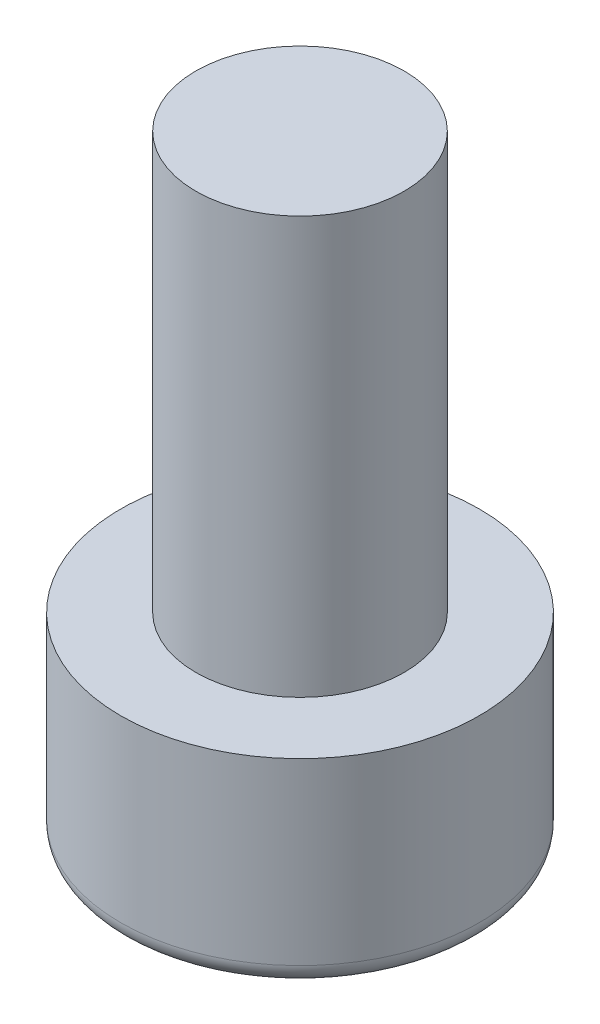
ISO-10303-21;
HEADER;
FILE_DESCRIPTION(('STEP AP214'),'2;1');
FILE_NAME('part.step','',(''),(''),'','','');
FILE_SCHEMA(('AUTOMOTIVE_DESIGN { 1 0 10303 214 1 1 1 1 }'));
ENDSEC;
DATA;
#1=APPLICATION_CONTEXT('core data for automotive mechanical design processes');
#2=APPLICATION_PROTOCOL_DEFINITION('international standard','automotive_design',2000,#1);
#3=PRODUCT_CONTEXT('',#1,'mechanical');
#4=PRODUCT('Part','Part','',(#3));
#5=PRODUCT_RELATED_PRODUCT_CATEGORY('part','',(#4));
#6=PRODUCT_DEFINITION_FORMATION('','',#4);
#7=PRODUCT_DEFINITION_CONTEXT('part definition',#1,'design');
#8=PRODUCT_DEFINITION('design','',#6,#7);
#9=PRODUCT_DEFINITION_SHAPE('','',#8);
#10=(LENGTH_UNIT() NAMED_UNIT(*) SI_UNIT(.MILLI.,.METRE.));
#11=(NAMED_UNIT(*) PLANE_ANGLE_UNIT() SI_UNIT($,.RADIAN.));
#12=(NAMED_UNIT(*) SI_UNIT($,.STERADIAN.) SOLID_ANGLE_UNIT());
#13=UNCERTAINTY_MEASURE_WITH_UNIT(LENGTH_MEASURE(1.E-05),#10,'distance_accuracy_value','');
#14=(GEOMETRIC_REPRESENTATION_CONTEXT(3) GLOBAL_UNCERTAINTY_ASSIGNED_CONTEXT((#13)) GLOBAL_UNIT_ASSIGNED_CONTEXT((#10,
#11,#12)) REPRESENTATION_CONTEXT('',''));
#15=CARTESIAN_POINT('',(0.,0.,0.));
#16=DIRECTION('',(0.,0.,1.));
#17=DIRECTION('',(1.,0.,0.));
#18=AXIS2_PLACEMENT_3D('',#15,#16,#17);
#19=CARTESIAN_POINT('',(0.,4.8,0.));
#20=DIRECTION('',(0.,-1.,0.));
#21=DIRECTION('',(0.,0.,-1.));
#22=AXIS2_PLACEMENT_3D('',#19,#20,#21);
#23=CYLINDRICAL_SURFACE('',#22,4.3);
#24=CARTESIAN_POINT('',(0.,0.5,0.));
#25=DIRECTION('',(0.,1.,0.));
#26=DIRECTION('',(0.,0.,1.));
#27=AXIS2_PLACEMENT_3D('',#24,#25,#26);
#28=CIRCLE('',#27,4.3);
#29=CARTESIAN_POINT('',(0.,0.5,4.3));
#30=VERTEX_POINT('',#29);
#31=EDGE_CURVE('E220',#30,#30,#28,.T.);
#32=ORIENTED_EDGE('',*,*,#31,.T.);
#33=EDGE_LOOP('',(#32));
#34=FACE_BOUND('',#33,.T.);
#35=CARTESIAN_POINT('',(0.,4.8,0.));
#36=DIRECTION('',(0.,1.,0.));
#37=DIRECTION('',(0.,0.,1.));
#38=AXIS2_PLACEMENT_3D('',#35,#36,#37);
#39=CIRCLE('',#38,4.3);
#40=CARTESIAN_POINT('',(0.,4.8,4.3));
#41=VERTEX_POINT('',#40);
#42=EDGE_CURVE('E275',#41,#41,#39,.T.);
#43=ORIENTED_EDGE('',*,*,#42,.F.);
#44=EDGE_LOOP('',(#43));
#45=FACE_BOUND('',#44,.T.);
#46=ADVANCED_FACE('F39',(#34,#45),#23,.T.);
#47=CARTESIAN_POINT('',(0.,4.8,0.));
#48=DIRECTION('',(0.,1.,0.));
#49=DIRECTION('',(0.,0.,1.));
#50=AXIS2_PLACEMENT_3D('',#47,#48,#49);
#51=PLANE('',#50);
#52=CARTESIAN_POINT('',(0.,4.8,0.));
#53=DIRECTION('',(0.,1.,0.));
#54=DIRECTION('',(0.,0.,1.));
#55=AXIS2_PLACEMENT_3D('',#52,#53,#54);
#56=CIRCLE('',#55,2.5);
#57=CARTESIAN_POINT('',(0.,4.8,2.5));
#58=VERTEX_POINT('',#57);
#59=EDGE_CURVE('E163',#58,#58,#56,.T.);
#60=ORIENTED_EDGE('',*,*,#59,.F.);
#61=EDGE_LOOP('',(#60));
#62=FACE_BOUND('',#61,.T.);
#63=ORIENTED_EDGE('',*,*,#42,.T.);
#64=EDGE_LOOP('',(#63));
#65=FACE_BOUND('',#64,.T.);
#66=ADVANCED_FACE('F367',(#62,#65),#51,.T.);
#67=CARTESIAN_POINT('',(0.,0.,0.));
#68=DIRECTION('',(0.,1.,0.));
#69=DIRECTION('',(0.,0.,1.));
#70=AXIS2_PLACEMENT_3D('',#67,#68,#69);
#71=PLANE('',#70);
#72=DIRECTION('',(1.,0.,0.));
#73=VECTOR('',#72,1.);
#74=CARTESIAN_POINT('',(0.,0.,-2.5));
#75=LINE('',#74,#73);
#76=CARTESIAN_POINT('',(1.44337567297406,0.,-2.5));
#77=VERTEX_POINT('',#76);
#78=CARTESIAN_POINT('',(-1.44337567297407,0.,-2.5));
#79=VERTEX_POINT('',#78);
#80=EDGE_CURVE('E254',#77,#79,#75,.F.);
#81=ORIENTED_EDGE('',*,*,#80,.T.);
#82=DIRECTION('',(0.5,0.,-0.866025403784439));
#83=VECTOR('',#82,1.);
#84=CARTESIAN_POINT('',(-2.1650635094611,0.,-1.25));
#85=LINE('',#84,#83);
#86=CARTESIAN_POINT('',(-2.88675134594813,0.,0.));
#87=VERTEX_POINT('',#86);
#88=EDGE_CURVE('E141',#79,#87,#85,.F.);
#89=ORIENTED_EDGE('',*,*,#88,.T.);
#90=DIRECTION('',(-0.5,0.,-0.866025403784438));
#91=VECTOR('',#90,1.);
#92=CARTESIAN_POINT('',(-2.1650635094611,0.,1.25));
#93=LINE('',#92,#91);
#94=CARTESIAN_POINT('',(-1.44337567297406,0.,2.5));
#95=VERTEX_POINT('',#94);
#96=EDGE_CURVE('E266',#87,#95,#93,.F.);
#97=ORIENTED_EDGE('',*,*,#96,.T.);
#98=DIRECTION('',(-1.,0.,0.));
#99=VECTOR('',#98,1.);
#100=CARTESIAN_POINT('',(0.,0.,2.5));
#101=LINE('',#100,#99);
#102=CARTESIAN_POINT('',(1.44337567297407,0.,2.5));
#103=VERTEX_POINT('',#102);
#104=EDGE_CURVE('E263',#95,#103,#101,.F.);
#105=ORIENTED_EDGE('',*,*,#104,.T.);
#106=DIRECTION('',(-0.5,0.,0.866025403784439));
#107=VECTOR('',#106,1.);
#108=CARTESIAN_POINT('',(2.1650635094611,0.,1.25));
#109=LINE('',#108,#107);
#110=CARTESIAN_POINT('',(2.88675134594813,0.,0.));
#111=VERTEX_POINT('',#110);
#112=EDGE_CURVE('E260',#103,#111,#109,.F.);
#113=ORIENTED_EDGE('',*,*,#112,.T.);
#114=DIRECTION('',(0.5,0.,0.866025403784439));
#115=VECTOR('',#114,1.);
#116=CARTESIAN_POINT('',(2.1650635094611,0.,-1.25));
#117=LINE('',#116,#115);
#118=EDGE_CURVE('E257',#111,#77,#117,.F.);
#119=ORIENTED_EDGE('',*,*,#118,.T.);
#120=EDGE_LOOP('',(#81,#89,#97,#105,#113,#119));
#121=FACE_BOUND('',#120,.T.);
#122=CARTESIAN_POINT('',(0.,0.,0.));
#123=DIRECTION('',(0.,1.,0.));
#124=DIRECTION('',(0.,0.,1.));
#125=AXIS2_PLACEMENT_3D('',#122,#123,#124);
#126=CIRCLE('',#125,3.8);
#127=CARTESIAN_POINT('',(0.,0.,3.8));
#128=VERTEX_POINT('',#127);
#129=EDGE_CURVE('E269',#128,#128,#126,.F.);
#130=ORIENTED_EDGE('',*,*,#129,.T.);
#131=EDGE_LOOP('',(#130));
#132=FACE_BOUND('',#131,.T.);
#133=ADVANCED_FACE('F351',(#121,#132),#71,.F.);
#134=CARTESIAN_POINT('',(0.,14.8,0.));
#135=DIRECTION('',(0.,-1.,0.));
#136=DIRECTION('',(0.,0.,-1.));
#137=AXIS2_PLACEMENT_3D('',#134,#135,#136);
#138=CYLINDRICAL_SURFACE('',#137,2.5);
#139=CARTESIAN_POINT('',(0.,14.8,0.));
#140=DIRECTION('',(0.,1.,0.));
#141=DIRECTION('',(0.,0.,1.));
#142=AXIS2_PLACEMENT_3D('',#139,#140,#141);
#143=CIRCLE('',#142,2.5);
#144=CARTESIAN_POINT('',(0.,14.8,2.5));
#145=VERTEX_POINT('',#144);
#146=EDGE_CURVE('E279',#145,#145,#143,.T.);
#147=ORIENTED_EDGE('',*,*,#146,.F.);
#148=EDGE_LOOP('',(#147));
#149=FACE_BOUND('',#148,.T.);
#150=ORIENTED_EDGE('',*,*,#59,.T.);
#151=EDGE_LOOP('',(#150));
#152=FACE_BOUND('',#151,.T.);
#153=ADVANCED_FACE('F377',(#149,#152),#138,.T.);
#154=CARTESIAN_POINT('',(0.,14.8,0.));
#155=DIRECTION('',(0.,1.,0.));
#156=DIRECTION('',(0.,0.,1.));
#157=AXIS2_PLACEMENT_3D('',#154,#155,#156);
#158=PLANE('',#157);
#159=ORIENTED_EDGE('',*,*,#146,.T.);
#160=EDGE_LOOP('',(#159));
#161=FACE_BOUND('',#160,.T.);
#162=ADVANCED_FACE('F381',(#161),#158,.T.);
#163=CARTESIAN_POINT('',(1.15470053837925,3.25,2.));
#164=DIRECTION('',(0.,0.,1.));
#165=DIRECTION('',(1.,0.,0.));
#166=AXIS2_PLACEMENT_3D('',#163,#164,#165);
#167=PLANE('',#166);
#168=DIRECTION('',(0.,-1.,0.));
#169=VECTOR('',#168,1.);
#170=CARTESIAN_POINT('',(1.15470053837925,3.25,2.));
#171=LINE('',#170,#169);
#172=CARTESIAN_POINT('',(1.15470053837925,2.75,2.));
#173=VERTEX_POINT('',#172);
#174=CARTESIAN_POINT('',(1.15470053837925,0.500000000000001,2.));
#175=VERTEX_POINT('',#174);
#176=EDGE_CURVE('E286',#173,#175,#171,.T.);
#177=ORIENTED_EDGE('',*,*,#176,.T.);
#178=DIRECTION('',(-1.,0.,0.));
#179=VECTOR('',#178,1.);
#180=CARTESIAN_POINT('',(1.15470053837925,0.5,2.));
#181=LINE('',#180,#179);
#182=CARTESIAN_POINT('',(-1.15470053837925,0.500000000000001,2.));
#183=VERTEX_POINT('',#182);
#184=EDGE_CURVE('E230',#175,#183,#181,.T.);
#185=ORIENTED_EDGE('',*,*,#184,.T.);
#186=DIRECTION('',(0.,-1.,0.));
#187=VECTOR('',#186,1.);
#188=CARTESIAN_POINT('',(-1.15470053837925,3.25,2.));
#189=LINE('',#188,#187);
#190=CARTESIAN_POINT('',(-1.15470053837925,2.75,2.));
#191=VERTEX_POINT('',#190);
#192=EDGE_CURVE('E192',#191,#183,#189,.T.);
#193=ORIENTED_EDGE('',*,*,#192,.F.);
#194=DIRECTION('',(-1.,0.,0.));
#195=VECTOR('',#194,1.);
#196=CARTESIAN_POINT('',(1.15470053837925,2.75,2.));
#197=LINE('',#196,#195);
#198=EDGE_CURVE('E233',#191,#173,#197,.F.);
#199=ORIENTED_EDGE('',*,*,#198,.T.);
#200=EDGE_LOOP('',(#177,#185,#193,#199));
#201=FACE_BOUND('',#200,.T.);
#202=ADVANCED_FACE('F303',(#201),#167,.F.);
#203=CARTESIAN_POINT('',(2.3094010767585,3.25,0.));
#204=DIRECTION('',(0.866025403784439,0.,0.5));
#205=DIRECTION('',(0.5,0.,-0.866025403784439));
#206=AXIS2_PLACEMENT_3D('',#203,#204,#205);
#207=PLANE('',#206);
#208=DIRECTION('',(0.,-1.,0.));
#209=VECTOR('',#208,1.);
#210=CARTESIAN_POINT('',(2.3094010767585,3.25,0.));
#211=LINE('',#210,#209);
#212=CARTESIAN_POINT('',(2.3094010767585,2.75,0.));
#213=VERTEX_POINT('',#212);
#214=CARTESIAN_POINT('',(2.3094010767585,0.500000000000001,0.));
#215=VERTEX_POINT('',#214);
#216=EDGE_CURVE('E294',#213,#215,#211,.T.);
#217=ORIENTED_EDGE('',*,*,#216,.T.);
#218=DIRECTION('',(-0.5,0.,0.866025403784439));
#219=VECTOR('',#218,1.);
#220=CARTESIAN_POINT('',(2.3094010767585,0.5,0.));
#221=LINE('',#220,#219);
#222=EDGE_CURVE('E236',#215,#175,#221,.T.);
#223=ORIENTED_EDGE('',*,*,#222,.T.);
#224=ORIENTED_EDGE('',*,*,#176,.F.);
#225=DIRECTION('',(-0.5,0.,0.866025403784439));
#226=VECTOR('',#225,1.);
#227=CARTESIAN_POINT('',(2.3094010767585,2.75,0.));
#228=LINE('',#227,#226);
#229=EDGE_CURVE('E239',#173,#213,#228,.F.);
#230=ORIENTED_EDGE('',*,*,#229,.T.);
#231=EDGE_LOOP('',(#217,#223,#224,#230));
#232=FACE_BOUND('',#231,.T.);
#233=ADVANCED_FACE('F336',(#232),#207,.F.);
#234=CARTESIAN_POINT('',(1.15470053837925,3.25,-2.));
#235=DIRECTION('',(0.866025403784438,0.,-0.5));
#236=DIRECTION('',(-0.5,0.,-0.866025403784439));
#237=AXIS2_PLACEMENT_3D('',#234,#235,#236);
#238=PLANE('',#237);
#239=DIRECTION('',(0.,-1.,0.));
#240=VECTOR('',#239,1.);
#241=CARTESIAN_POINT('',(1.15470053837925,3.25,-2.));
#242=LINE('',#241,#240);
#243=CARTESIAN_POINT('',(1.15470053837925,2.75,-2.));
#244=VERTEX_POINT('',#243);
#245=CARTESIAN_POINT('',(1.15470053837925,0.500000000000001,-2.));
#246=VERTEX_POINT('',#245);
#247=EDGE_CURVE('E135',#244,#246,#242,.T.);
#248=ORIENTED_EDGE('',*,*,#247,.T.);
#249=DIRECTION('',(0.5,0.,0.866025403784439));
#250=VECTOR('',#249,1.);
#251=CARTESIAN_POINT('',(1.15470053837925,0.5,-2.));
#252=LINE('',#251,#250);
#253=EDGE_CURVE('E243',#246,#215,#252,.T.);
#254=ORIENTED_EDGE('',*,*,#253,.T.);
#255=ORIENTED_EDGE('',*,*,#216,.F.);
#256=DIRECTION('',(0.5,0.,0.866025403784439));
#257=VECTOR('',#256,1.);
#258=CARTESIAN_POINT('',(1.15470053837925,2.75,-2.));
#259=LINE('',#258,#257);
#260=EDGE_CURVE('E246',#213,#244,#259,.F.);
#261=ORIENTED_EDGE('',*,*,#260,.T.);
#262=EDGE_LOOP('',(#248,#254,#255,#261));
#263=FACE_BOUND('',#262,.T.);
#264=ADVANCED_FACE('F338',(#263),#238,.F.);
#265=CARTESIAN_POINT('',(-1.15470053837925,3.25,-2.));
#266=DIRECTION('',(0.,0.,-1.));
#267=DIRECTION('',(-1.,0.,0.));
#268=AXIS2_PLACEMENT_3D('',#265,#266,#267);
#269=PLANE('',#268);
#270=DIRECTION('',(0.,-1.,0.));
#271=VECTOR('',#270,1.);
#272=CARTESIAN_POINT('',(-1.15470053837925,3.25,-2.));
#273=LINE('',#272,#271);
#274=CARTESIAN_POINT('',(-1.15470053837925,2.75,-2.));
#275=VERTEX_POINT('',#274);
#276=CARTESIAN_POINT('',(-1.15470053837925,0.500000000000001,-2.));
#277=VERTEX_POINT('',#276);
#278=EDGE_CURVE('E133',#275,#277,#273,.T.);
#279=ORIENTED_EDGE('',*,*,#278,.T.);
#280=DIRECTION('',(1.,0.,0.));
#281=VECTOR('',#280,1.);
#282=CARTESIAN_POINT('',(-1.15470053837925,0.5,-2.));
#283=LINE('',#282,#281);
#284=EDGE_CURVE('E140',#277,#246,#283,.T.);
#285=ORIENTED_EDGE('',*,*,#284,.T.);
#286=ORIENTED_EDGE('',*,*,#247,.F.);
#287=DIRECTION('',(1.,0.,0.));
#288=VECTOR('',#287,1.);
#289=CARTESIAN_POINT('',(-1.15470053837925,2.75,-2.));
#290=LINE('',#289,#288);
#291=EDGE_CURVE('E130',#244,#275,#290,.F.);
#292=ORIENTED_EDGE('',*,*,#291,.T.);
#293=EDGE_LOOP('',(#279,#285,#286,#292));
#294=FACE_BOUND('',#293,.T.);
#295=ADVANCED_FACE('F132',(#294),#269,.F.);
#296=CARTESIAN_POINT('',(-2.3094010767585,3.25,0.));
#297=DIRECTION('',(-0.866025403784439,0.,-0.5));
#298=DIRECTION('',(-0.5,0.,0.866025403784439));
#299=AXIS2_PLACEMENT_3D('',#296,#297,#298);
#300=PLANE('',#299);
#301=DIRECTION('',(0.,-1.,0.));
#302=VECTOR('',#301,1.);
#303=CARTESIAN_POINT('',(-2.3094010767585,3.25,0.));
#304=LINE('',#303,#302);
#305=CARTESIAN_POINT('',(-2.3094010767585,2.75,0.));
#306=VERTEX_POINT('',#305);
#307=CARTESIAN_POINT('',(-2.3094010767585,0.500000000000001,0.));
#308=VERTEX_POINT('',#307);
#309=EDGE_CURVE('E153',#306,#308,#304,.T.);
#310=ORIENTED_EDGE('',*,*,#309,.T.);
#311=DIRECTION('',(0.5,0.,-0.866025403784439));
#312=VECTOR('',#311,1.);
#313=CARTESIAN_POINT('',(-2.3094010767585,0.5,0.));
#314=LINE('',#313,#312);
#315=EDGE_CURVE('E151',#308,#277,#314,.T.);
#316=ORIENTED_EDGE('',*,*,#315,.T.);
#317=ORIENTED_EDGE('',*,*,#278,.F.);
#318=DIRECTION('',(0.5,0.,-0.866025403784439));
#319=VECTOR('',#318,1.);
#320=CARTESIAN_POINT('',(-2.3094010767585,2.75,0.));
#321=LINE('',#320,#319);
#322=EDGE_CURVE('E148',#275,#306,#321,.F.);
#323=ORIENTED_EDGE('',*,*,#322,.T.);
#324=EDGE_LOOP('',(#310,#316,#317,#323));
#325=FACE_BOUND('',#324,.T.);
#326=ADVANCED_FACE('F147',(#325),#300,.F.);
#327=CARTESIAN_POINT('',(-1.15470053837925,3.25,2.));
#328=DIRECTION('',(-0.866025403784438,0.,0.5));
#329=DIRECTION('',(0.5,0.,0.866025403784438));
#330=AXIS2_PLACEMENT_3D('',#327,#328,#329);
#331=PLANE('',#330);
#332=ORIENTED_EDGE('',*,*,#192,.T.);
#333=DIRECTION('',(-0.5,0.,-0.866025403784438));
#334=VECTOR('',#333,1.);
#335=CARTESIAN_POINT('',(-1.15470053837925,0.5,2.));
#336=LINE('',#335,#334);
#337=EDGE_CURVE('E224',#183,#308,#336,.T.);
#338=ORIENTED_EDGE('',*,*,#337,.T.);
#339=ORIENTED_EDGE('',*,*,#309,.F.);
#340=DIRECTION('',(-0.5,0.,-0.866025403784438));
#341=VECTOR('',#340,1.);
#342=CARTESIAN_POINT('',(-1.15470053837925,2.75,2.));
#343=LINE('',#342,#341);
#344=EDGE_CURVE('E227',#306,#191,#343,.F.);
#345=ORIENTED_EDGE('',*,*,#344,.T.);
#346=EDGE_LOOP('',(#332,#338,#339,#345));
#347=FACE_BOUND('',#346,.T.);
#348=ADVANCED_FACE('F324',(#347),#331,.F.);
#349=CARTESIAN_POINT('',(0.,3.25,0.));
#350=DIRECTION('',(0.,-1.,0.));
#351=DIRECTION('',(0.,0.,-1.));
#352=AXIS2_PLACEMENT_3D('',#349,#350,#351);
#353=PLANE('',#352);
#354=DIRECTION('',(0.5,0.,0.866025403784439));
#355=VECTOR('',#354,1.);
#356=CARTESIAN_POINT('',(1.29903810567666,3.25,-0.75));
#357=LINE('',#356,#355);
#358=CARTESIAN_POINT('',(0.866025403784438,3.25,-1.5));
#359=VERTEX_POINT('',#358);
#360=CARTESIAN_POINT('',(1.73205080756888,3.25,0.));
#361=VERTEX_POINT('',#360);
#362=EDGE_CURVE('E49',#359,#361,#357,.T.);
#363=ORIENTED_EDGE('',*,*,#362,.T.);
#364=DIRECTION('',(-0.5,0.,0.866025403784439));
#365=VECTOR('',#364,1.);
#366=CARTESIAN_POINT('',(1.29903810567666,3.25,0.75));
#367=LINE('',#366,#365);
#368=CARTESIAN_POINT('',(0.86602540378444,3.25,1.5));
#369=VERTEX_POINT('',#368);
#370=EDGE_CURVE('E11',#361,#369,#367,.T.);
#371=ORIENTED_EDGE('',*,*,#370,.T.);
#372=DIRECTION('',(-1.,0.,0.));
#373=VECTOR('',#372,1.);
#374=CARTESIAN_POINT('',(0.,3.25,1.5));
#375=LINE('',#374,#373);
#376=CARTESIAN_POINT('',(-0.866025403784439,3.25,1.5));
#377=VERTEX_POINT('',#376);
#378=EDGE_CURVE('E217',#369,#377,#375,.T.);
#379=ORIENTED_EDGE('',*,*,#378,.T.);
#380=DIRECTION('',(-0.5,0.,-0.866025403784438));
#381=VECTOR('',#380,1.);
#382=CARTESIAN_POINT('',(-1.29903810567666,3.25,0.750000000000001));
#383=LINE('',#382,#381);
#384=CARTESIAN_POINT('',(-1.73205080756888,3.25,0.));
#385=VERTEX_POINT('',#384);
#386=EDGE_CURVE('E214',#377,#385,#383,.T.);
#387=ORIENTED_EDGE('',*,*,#386,.T.);
#388=DIRECTION('',(0.5,0.,-0.866025403784439));
#389=VECTOR('',#388,1.);
#390=CARTESIAN_POINT('',(-1.29903810567666,3.25,-0.75));
#391=LINE('',#390,#389);
#392=CARTESIAN_POINT('',(-0.86602540378444,3.25,-1.5));
#393=VERTEX_POINT('',#392);
#394=EDGE_CURVE('E211',#385,#393,#391,.T.);
#395=ORIENTED_EDGE('',*,*,#394,.T.);
#396=DIRECTION('',(1.,0.,0.));
#397=VECTOR('',#396,1.);
#398=CARTESIAN_POINT('',(0.,3.25,-1.5));
#399=LINE('',#398,#397);
#400=EDGE_CURVE('E60',#393,#359,#399,.T.);
#401=ORIENTED_EDGE('',*,*,#400,.T.);
#402=EDGE_LOOP('',(#363,#371,#379,#387,#395,#401));
#403=FACE_BOUND('',#402,.T.);
#404=ADVANCED_FACE('F390',(#403),#353,.T.);
#405=CARTESIAN_POINT('',(2.74241377865072,0.5,0.250000000000001));
#406=DIRECTION('',(-0.5,0.,0.866025403784439));
#407=DIRECTION('',(0.866025403784439,0.,0.5));
#408=AXIS2_PLACEMENT_3D('',#405,#406,#407);
#409=CYLINDRICAL_SURFACE('',#408,0.5);
#410=CARTESIAN_POINT('',(2.88675134594813,0.5,0.));
#411=DIRECTION('',(0.,0.,1.));
#412=DIRECTION('',(1.,0.,0.));
#413=AXIS2_PLACEMENT_3D('',#410,#411,#412);
#414=ELLIPSE('',#413,0.577350269189626,0.5);
#415=EDGE_CURVE('E193',#111,#215,#414,.F.);
#416=ORIENTED_EDGE('',*,*,#415,.F.);
#417=ORIENTED_EDGE('',*,*,#112,.F.);
#418=CARTESIAN_POINT('',(1.44337567297407,0.5,2.5));
#419=DIRECTION('',(-0.866025403784438,0.,0.5));
#420=DIRECTION('',(0.5,0.,0.866025403784438));
#421=AXIS2_PLACEMENT_3D('',#418,#419,#420);
#422=ELLIPSE('',#421,0.577350269189626,0.5);
#423=EDGE_CURVE('E188',#175,#103,#422,.T.);
#424=ORIENTED_EDGE('',*,*,#423,.F.);
#425=ORIENTED_EDGE('',*,*,#222,.F.);
#426=EDGE_LOOP('',(#416,#417,#424,#425));
#427=FACE_BOUND('',#426,.T.);
#428=ADVANCED_FACE('F313',(#427),#409,.T.);
#429=CARTESIAN_POINT('',(1.15470053837925,0.5,2.5));
#430=DIRECTION('',(-1.,0.,0.));
#431=DIRECTION('',(0.,0.,1.));
#432=AXIS2_PLACEMENT_3D('',#429,#430,#431);
#433=CYLINDRICAL_SURFACE('',#432,0.5);
#434=ORIENTED_EDGE('',*,*,#423,.T.);
#435=ORIENTED_EDGE('',*,*,#104,.F.);
#436=CARTESIAN_POINT('',(-1.44337567297406,0.5,2.5));
#437=DIRECTION('',(-0.866025403784439,0.,-0.5));
#438=DIRECTION('',(-0.5,0.,0.866025403784439));
#439=AXIS2_PLACEMENT_3D('',#436,#437,#438);
#440=ELLIPSE('',#439,0.577350269189626,0.5);
#441=EDGE_CURVE('E197',#183,#95,#440,.T.);
#442=ORIENTED_EDGE('',*,*,#441,.F.);
#443=ORIENTED_EDGE('',*,*,#184,.F.);
#444=EDGE_LOOP('',(#434,#435,#442,#443));
#445=FACE_BOUND('',#444,.T.);
#446=ADVANCED_FACE('F317',(#445),#433,.T.);
#447=CARTESIAN_POINT('',(1.58771324027147,0.5,-2.25));
#448=DIRECTION('',(0.5,0.,0.866025403784439));
#449=DIRECTION('',(0.866025403784438,0.,-0.5));
#450=AXIS2_PLACEMENT_3D('',#447,#448,#449);
#451=CYLINDRICAL_SURFACE('',#450,0.5);
#452=ORIENTED_EDGE('',*,*,#415,.T.);
#453=ORIENTED_EDGE('',*,*,#253,.F.);
#454=CARTESIAN_POINT('',(1.44337567297406,0.5,-2.5));
#455=DIRECTION('',(0.866025403784439,0.,0.5));
#456=DIRECTION('',(0.5,0.,-0.866025403784439));
#457=AXIS2_PLACEMENT_3D('',#454,#455,#456);
#458=ELLIPSE('',#457,0.577350269189626,0.5);
#459=EDGE_CURVE('E201',#77,#246,#458,.F.);
#460=ORIENTED_EDGE('',*,*,#459,.F.);
#461=ORIENTED_EDGE('',*,*,#118,.F.);
#462=EDGE_LOOP('',(#452,#453,#460,#461));
#463=FACE_BOUND('',#462,.T.);
#464=ADVANCED_FACE('F342',(#463),#451,.T.);
#465=CARTESIAN_POINT('',(-1.58771324027147,0.5,2.25));
#466=DIRECTION('',(-0.5,0.,-0.866025403784438));
#467=DIRECTION('',(-0.866025403784438,0.,0.5));
#468=AXIS2_PLACEMENT_3D('',#465,#466,#467);
#469=CYLINDRICAL_SURFACE('',#468,0.5);
#470=ORIENTED_EDGE('',*,*,#441,.T.);
#471=ORIENTED_EDGE('',*,*,#96,.F.);
#472=CARTESIAN_POINT('',(-2.88675134594813,0.5,0.));
#473=DIRECTION('',(0.,0.,-1.));
#474=DIRECTION('',(1.,0.,0.));
#475=AXIS2_PLACEMENT_3D('',#472,#473,#474);
#476=ELLIPSE('',#475,0.577350269189626,0.5);
#477=EDGE_CURVE('E170',#308,#87,#476,.T.);
#478=ORIENTED_EDGE('',*,*,#477,.F.);
#479=ORIENTED_EDGE('',*,*,#337,.F.);
#480=EDGE_LOOP('',(#470,#471,#478,#479));
#481=FACE_BOUND('',#480,.T.);
#482=ADVANCED_FACE('F322',(#481),#469,.T.);
#483=CARTESIAN_POINT('',(-1.15470053837925,0.5,-2.5));
#484=DIRECTION('',(1.,0.,0.));
#485=DIRECTION('',(0.,0.,-1.));
#486=AXIS2_PLACEMENT_3D('',#483,#484,#485);
#487=CYLINDRICAL_SURFACE('',#486,0.5);
#488=ORIENTED_EDGE('',*,*,#459,.T.);
#489=ORIENTED_EDGE('',*,*,#284,.F.);
#490=CARTESIAN_POINT('',(-1.44337567297407,0.5,-2.5));
#491=DIRECTION('',(0.866025403784438,0.,-0.5));
#492=DIRECTION('',(-0.5,0.,-0.866025403784438));
#493=AXIS2_PLACEMENT_3D('',#490,#491,#492);
#494=ELLIPSE('',#493,0.577350269189626,0.5);
#495=EDGE_CURVE('E167',#79,#277,#494,.F.);
#496=ORIENTED_EDGE('',*,*,#495,.F.);
#497=ORIENTED_EDGE('',*,*,#80,.F.);
#498=EDGE_LOOP('',(#488,#489,#496,#497));
#499=FACE_BOUND('',#498,.T.);
#500=ADVANCED_FACE('F347',(#499),#487,.T.);
#501=CARTESIAN_POINT('',(-2.74241377865072,0.5,-0.249999999999999));
#502=DIRECTION('',(0.5,0.,-0.866025403784439));
#503=DIRECTION('',(-0.866025403784439,0.,-0.5));
#504=AXIS2_PLACEMENT_3D('',#501,#502,#503);
#505=CYLINDRICAL_SURFACE('',#504,0.5);
#506=ORIENTED_EDGE('',*,*,#477,.T.);
#507=ORIENTED_EDGE('',*,*,#88,.F.);
#508=ORIENTED_EDGE('',*,*,#495,.T.);
#509=ORIENTED_EDGE('',*,*,#315,.F.);
#510=EDGE_LOOP('',(#506,#507,#508,#509));
#511=FACE_BOUND('',#510,.T.);
#512=ADVANCED_FACE('F354',(#511),#505,.T.);
#513=CARTESIAN_POINT('',(0.,0.5,0.));
#514=DIRECTION('',(0.,1.,0.));
#515=DIRECTION('',(0.,0.,1.));
#516=AXIS2_PLACEMENT_3D('',#513,#514,#515);
#517=TOROIDAL_SURFACE('',#516,3.8,0.5);
#518=ORIENTED_EDGE('',*,*,#129,.F.);
#519=EDGE_LOOP('',(#518));
#520=FACE_BOUND('',#519,.T.);
#521=ORIENTED_EDGE('',*,*,#31,.F.);
#522=EDGE_LOOP('',(#521));
#523=FACE_BOUND('',#522,.T.);
#524=ADVANCED_FACE('F356',(#520,#523),#517,.T.);
#525=CARTESIAN_POINT('',(-1.29903810567666,2.75,-0.749999999999999));
#526=DIRECTION('',(0.5,0.,-0.866025403784439));
#527=DIRECTION('',(-0.866025403784439,0.,-0.5));
#528=AXIS2_PLACEMENT_3D('',#525,#526,#527);
#529=CYLINDRICAL_SURFACE('',#528,0.5);
#530=CARTESIAN_POINT('',(-1.73205080756888,2.75,0.));
#531=DIRECTION('',(0.,0.,-1.));
#532=DIRECTION('',(1.,0.,0.));
#533=AXIS2_PLACEMENT_3D('',#530,#531,#532);
#534=ELLIPSE('',#533,0.577350269189626,0.5);
#535=EDGE_CURVE('E160',#306,#385,#534,.T.);
#536=ORIENTED_EDGE('',*,*,#535,.F.);
#537=ORIENTED_EDGE('',*,*,#322,.F.);
#538=CARTESIAN_POINT('',(-0.86602540378444,2.75,-1.5));
#539=DIRECTION('',(0.866025403784438,0.,-0.5));
#540=DIRECTION('',(0.5,0.,0.866025403784438));
#541=AXIS2_PLACEMENT_3D('',#538,#539,#540);
#542=ELLIPSE('',#541,0.577350269189626,0.5);
#543=EDGE_CURVE('E43',#393,#275,#542,.F.);
#544=ORIENTED_EDGE('',*,*,#543,.F.);
#545=ORIENTED_EDGE('',*,*,#394,.F.);
#546=EDGE_LOOP('',(#536,#537,#544,#545));
#547=FACE_BOUND('',#546,.T.);
#548=ADVANCED_FACE('F41',(#547),#529,.F.);
#549=CARTESIAN_POINT('',(0.,2.75,-1.5));
#550=DIRECTION('',(1.,0.,0.));
#551=DIRECTION('',(0.,0.,-1.));
#552=AXIS2_PLACEMENT_3D('',#549,#550,#551);
#553=CYLINDRICAL_SURFACE('',#552,0.5);
#554=ORIENTED_EDGE('',*,*,#543,.T.);
#555=ORIENTED_EDGE('',*,*,#291,.F.);
#556=CARTESIAN_POINT('',(0.866025403784438,2.75,-1.5));
#557=DIRECTION('',(0.866025403784439,0.,0.5));
#558=DIRECTION('',(-0.5,0.,0.866025403784439));
#559=AXIS2_PLACEMENT_3D('',#556,#557,#558);
#560=ELLIPSE('',#559,0.577350269189626,0.5);
#561=EDGE_CURVE('E172',#359,#244,#560,.F.);
#562=ORIENTED_EDGE('',*,*,#561,.F.);
#563=ORIENTED_EDGE('',*,*,#400,.F.);
#564=EDGE_LOOP('',(#554,#555,#562,#563));
#565=FACE_BOUND('',#564,.T.);
#566=ADVANCED_FACE('F165',(#565),#553,.F.);
#567=CARTESIAN_POINT('',(-1.29903810567666,2.75,0.750000000000001));
#568=DIRECTION('',(-0.5,0.,-0.866025403784438));
#569=DIRECTION('',(-0.866025403784438,0.,0.5));
#570=AXIS2_PLACEMENT_3D('',#567,#568,#569);
#571=CYLINDRICAL_SURFACE('',#570,0.5);
#572=ORIENTED_EDGE('',*,*,#535,.T.);
#573=ORIENTED_EDGE('',*,*,#386,.F.);
#574=CARTESIAN_POINT('',(-0.866025403784439,2.75,1.5));
#575=DIRECTION('',(-0.866025403784439,0.,-0.5));
#576=DIRECTION('',(0.5,0.,-0.866025403784439));
#577=AXIS2_PLACEMENT_3D('',#574,#575,#576);
#578=ELLIPSE('',#577,0.577350269189626,0.5);
#579=EDGE_CURVE('E176',#191,#377,#578,.T.);
#580=ORIENTED_EDGE('',*,*,#579,.F.);
#581=ORIENTED_EDGE('',*,*,#344,.F.);
#582=EDGE_LOOP('',(#572,#573,#580,#581));
#583=FACE_BOUND('',#582,.T.);
#584=ADVANCED_FACE('F326',(#583),#571,.F.);
#585=CARTESIAN_POINT('',(1.29903810567666,2.75,-0.75));
#586=DIRECTION('',(0.5,0.,0.866025403784439));
#587=DIRECTION('',(0.866025403784438,0.,-0.5));
#588=AXIS2_PLACEMENT_3D('',#585,#586,#587);
#589=CYLINDRICAL_SURFACE('',#588,0.5);
#590=ORIENTED_EDGE('',*,*,#561,.T.);
#591=ORIENTED_EDGE('',*,*,#260,.F.);
#592=CARTESIAN_POINT('',(1.73205080756888,2.75,0.));
#593=DIRECTION('',(0.,0.,1.));
#594=DIRECTION('',(-1.,0.,0.));
#595=AXIS2_PLACEMENT_3D('',#592,#593,#594);
#596=ELLIPSE('',#595,0.577350269189626,0.5);
#597=EDGE_CURVE('E182',#361,#213,#596,.F.);
#598=ORIENTED_EDGE('',*,*,#597,.F.);
#599=ORIENTED_EDGE('',*,*,#362,.F.);
#600=EDGE_LOOP('',(#590,#591,#598,#599));
#601=FACE_BOUND('',#600,.T.);
#602=ADVANCED_FACE('F414',(#601),#589,.F.);
#603=CARTESIAN_POINT('',(0.,2.75,1.5));
#604=DIRECTION('',(-1.,0.,0.));
#605=DIRECTION('',(0.,0.,1.));
#606=AXIS2_PLACEMENT_3D('',#603,#604,#605);
#607=CYLINDRICAL_SURFACE('',#606,0.5);
#608=ORIENTED_EDGE('',*,*,#579,.T.);
#609=ORIENTED_EDGE('',*,*,#378,.F.);
#610=CARTESIAN_POINT('',(0.86602540378444,2.75,1.5));
#611=DIRECTION('',(-0.866025403784438,0.,0.5));
#612=DIRECTION('',(0.5,0.,0.866025403784438));
#613=AXIS2_PLACEMENT_3D('',#610,#611,#612);
#614=ELLIPSE('',#613,0.577350269189626,0.5);
#615=EDGE_CURVE('E185',#173,#369,#614,.T.);
#616=ORIENTED_EDGE('',*,*,#615,.F.);
#617=ORIENTED_EDGE('',*,*,#198,.F.);
#618=EDGE_LOOP('',(#608,#609,#616,#617));
#619=FACE_BOUND('',#618,.T.);
#620=ADVANCED_FACE('F330',(#619),#607,.F.);
#621=CARTESIAN_POINT('',(1.29903810567666,2.75,0.75));
#622=DIRECTION('',(-0.5,0.,0.866025403784439));
#623=DIRECTION('',(0.866025403784439,0.,0.5));
#624=AXIS2_PLACEMENT_3D('',#621,#622,#623);
#625=CYLINDRICAL_SURFACE('',#624,0.5);
#626=ORIENTED_EDGE('',*,*,#597,.T.);
#627=ORIENTED_EDGE('',*,*,#229,.F.);
#628=ORIENTED_EDGE('',*,*,#615,.T.);
#629=ORIENTED_EDGE('',*,*,#370,.F.);
#630=EDGE_LOOP('',(#626,#627,#628,#629));
#631=FACE_BOUND('',#630,.T.);
#632=ADVANCED_FACE('F333',(#631),#625,.F.);
#633=CLOSED_SHELL('',(#46,#66,#133,#153,#162,#202,#233,#264,#295,#326,#348,#404,#428,#446,#464,
#482,#500,#512,#524,#548,#566,#584,#602,#620,#632));
#634=MANIFOLD_SOLID_BREP('B2',#633);
#635=ADVANCED_BREP_SHAPE_REPRESENTATION('',(#18,#634),#14);
#636=SHAPE_DEFINITION_REPRESENTATION(#9,#635);
ENDSEC;
END-ISO-10303-21;
